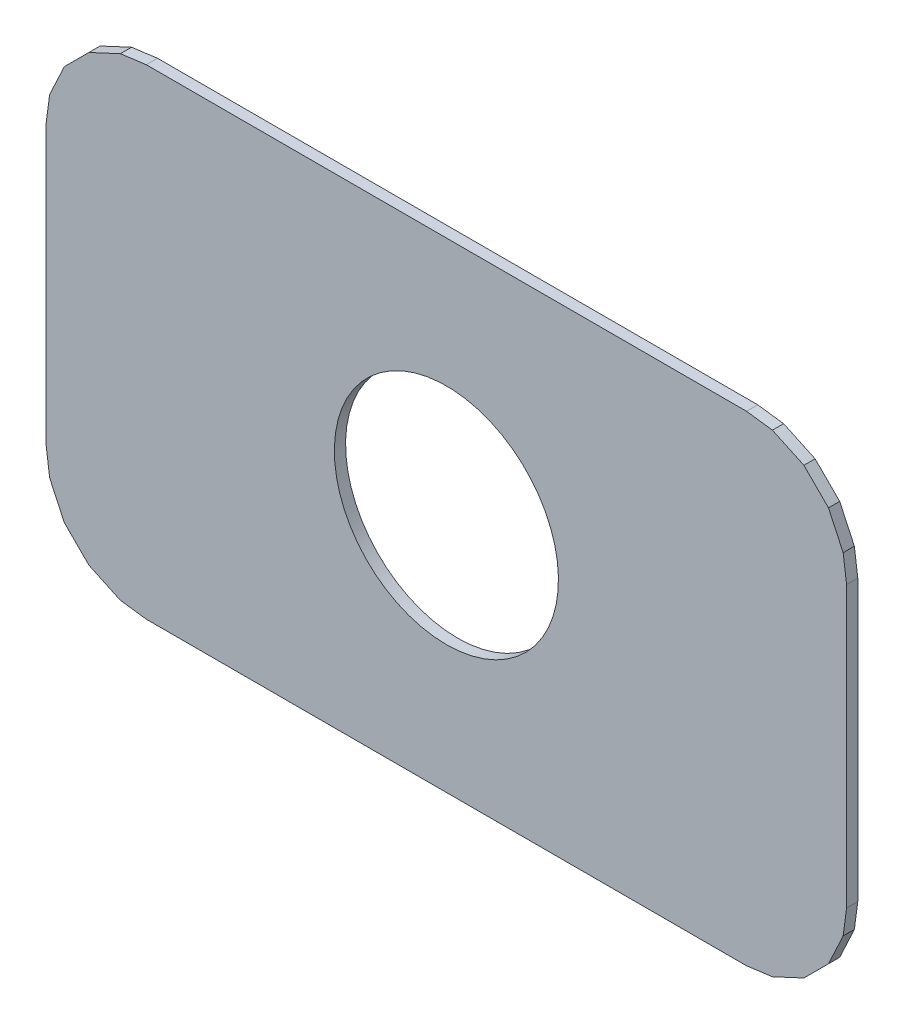
ISO-10303-21;
HEADER;
FILE_DESCRIPTION(('STEP AP214'),'2;1');
FILE_NAME('part.step','',(''),(''),'','','');
FILE_SCHEMA(('AUTOMOTIVE_DESIGN { 1 0 10303 214 1 1 1 1 }'));
ENDSEC;
DATA;
#1=APPLICATION_CONTEXT('core data for automotive mechanical design processes');
#2=APPLICATION_PROTOCOL_DEFINITION('international standard','automotive_design',2000,#1);
#3=PRODUCT_CONTEXT('',#1,'mechanical');
#4=PRODUCT('Part','Part','',(#3));
#5=PRODUCT_RELATED_PRODUCT_CATEGORY('part','',(#4));
#6=PRODUCT_DEFINITION_FORMATION('','',#4);
#7=PRODUCT_DEFINITION_CONTEXT('part definition',#1,'design');
#8=PRODUCT_DEFINITION('design','',#6,#7);
#9=PRODUCT_DEFINITION_SHAPE('','',#8);
#10=(LENGTH_UNIT() NAMED_UNIT(*) SI_UNIT(.MILLI.,.METRE.));
#11=(NAMED_UNIT(*) PLANE_ANGLE_UNIT() SI_UNIT($,.RADIAN.));
#12=(NAMED_UNIT(*) SI_UNIT($,.STERADIAN.) SOLID_ANGLE_UNIT());
#13=UNCERTAINTY_MEASURE_WITH_UNIT(LENGTH_MEASURE(1.E-05),#10,'distance_accuracy_value','');
#14=(GEOMETRIC_REPRESENTATION_CONTEXT(3) GLOBAL_UNCERTAINTY_ASSIGNED_CONTEXT((#13)) GLOBAL_UNIT_ASSIGNED_CONTEXT((#10,
#11,#12)) REPRESENTATION_CONTEXT('',''));
#15=CARTESIAN_POINT('',(0.,0.,0.));
#16=DIRECTION('',(0.,0.,1.));
#17=DIRECTION('',(1.,0.,0.));
#18=AXIS2_PLACEMENT_3D('',#15,#16,#17);
#19=CARTESIAN_POINT('',(115.401,-115.808,-0.045));
#20=DIRECTION('',(0.,0.,-1.));
#21=DIRECTION('',(0.,-1.,0.));
#22=AXIS2_PLACEMENT_3D('',#19,#20,#21);
#23=CYLINDRICAL_SURFACE('',#22,0.35);
#24=CARTESIAN_POINT('',(115.401,-115.808,1.67));
#25=DIRECTION('',(0.,0.,-1.));
#26=DIRECTION('',(0.,-1.,0.));
#27=AXIS2_PLACEMENT_3D('',#24,#25,#26);
#28=CIRCLE('',#27,0.35);
#29=CARTESIAN_POINT('',(115.401,-116.158,1.67));
#30=VERTEX_POINT('',#29);
#31=EDGE_CURVE('E415',#30,#30,#28,.T.);
#32=ORIENTED_EDGE('',*,*,#31,.T.);
#33=DIRECTION('',(0.,0.,1.));
#34=VECTOR('',#33,1.);
#35=CARTESIAN_POINT('',(115.401,-116.158,-0.045));
#36=LINE('',#35,#34);
#37=CARTESIAN_POINT('',(115.401,-116.158,1.705));
#38=VERTEX_POINT('',#37);
#39=EDGE_CURVE('E11',#30,#38,#36,.T.);
#40=ORIENTED_EDGE('',*,*,#39,.T.);
#41=CARTESIAN_POINT('',(115.401,-115.808,1.705));
#42=DIRECTION('',(0.,0.,-1.));
#43=DIRECTION('',(0.,-1.,0.));
#44=AXIS2_PLACEMENT_3D('',#41,#42,#43);
#45=CIRCLE('',#44,0.35);
#46=EDGE_CURVE('E335',#38,#38,#45,.T.);
#47=ORIENTED_EDGE('',*,*,#46,.F.);
#48=ORIENTED_EDGE('',*,*,#39,.F.);
#49=EDGE_LOOP('',(#32,#40,#47,#48));
#50=FACE_BOUND('',#49,.T.);
#51=ADVANCED_FACE('F17',(#50),#23,.F.);
#52=CARTESIAN_POINT('',(114.382619,-116.547352,1.67));
#53=DIRECTION('',(-0.422618610856986,-0.90630762424097,0.));
#54=DIRECTION('',(-0.90630762424097,0.422618610856986,0.));
#55=AXIS2_PLACEMENT_3D('',#52,#53,#54);
#56=PLANE('',#55);
#57=DIRECTION('',(0.,0.,1.));
#58=VECTOR('',#57,1.);
#59=CARTESIAN_POINT('',(114.382619,-116.547352,1.67));
#60=LINE('',#59,#58);
#61=CARTESIAN_POINT('',(114.382619,-116.547352,1.67));
#62=VERTEX_POINT('',#61);
#63=CARTESIAN_POINT('',(114.382619,-116.547352,1.705));
#64=VERTEX_POINT('',#63);
#65=EDGE_CURVE('E20',#62,#64,#60,.T.);
#66=ORIENTED_EDGE('',*,*,#65,.T.);
#67=DIRECTION('',(-0.90630762424097,0.422618610856986,0.));
#68=VECTOR('',#67,1.);
#69=CARTESIAN_POINT('',(114.382619,-116.547352,1.705));
#70=LINE('',#69,#68);
#71=CARTESIAN_POINT('',(114.284257,-116.501485,1.705));
#72=VERTEX_POINT('',#71);
#73=EDGE_CURVE('E285',#64,#72,#70,.T.);
#74=ORIENTED_EDGE('',*,*,#73,.T.);
#75=DIRECTION('',(0.,0.,1.));
#76=VECTOR('',#75,1.);
#77=CARTESIAN_POINT('',(114.284257,-116.501485,1.67));
#78=LINE('',#77,#76);
#79=CARTESIAN_POINT('',(114.284257,-116.501485,1.67));
#80=VERTEX_POINT('',#79);
#81=EDGE_CURVE('E384',#80,#72,#78,.T.);
#82=ORIENTED_EDGE('',*,*,#81,.F.);
#83=DIRECTION('',(-0.90630762424097,0.422618610856986,0.));
#84=VECTOR('',#83,1.);
#85=CARTESIAN_POINT('',(114.382619,-116.547352,1.67));
#86=LINE('',#85,#84);
#87=EDGE_CURVE('E370',#62,#80,#86,.T.);
#88=ORIENTED_EDGE('',*,*,#87,.F.);
#89=EDGE_LOOP('',(#66,#74,#82,#88));
#90=FACE_BOUND('',#89,.T.);
#91=ADVANCED_FACE('F533',(#90),#56,.T.);
#92=CARTESIAN_POINT('',(114.4635,-116.558,1.67));
#93=DIRECTION('',(-0.130523955190962,-0.99144515588171,0.));
#94=DIRECTION('',(-0.99144515588171,0.130523955190962,0.));
#95=AXIS2_PLACEMENT_3D('',#92,#93,#94);
#96=PLANE('',#95);
#97=DIRECTION('',(0.,0.,1.));
#98=VECTOR('',#97,1.);
#99=CARTESIAN_POINT('',(114.4635,-116.558,1.67));
#100=LINE('',#99,#98);
#101=CARTESIAN_POINT('',(114.4635,-116.558,1.67));
#102=VERTEX_POINT('',#101);
#103=CARTESIAN_POINT('',(114.4635,-116.558,1.705));
#104=VERTEX_POINT('',#103);
#105=EDGE_CURVE('E387',#102,#104,#100,.T.);
#106=ORIENTED_EDGE('',*,*,#105,.T.);
#107=DIRECTION('',(-0.99144515588171,0.130523955190962,0.));
#108=VECTOR('',#107,1.);
#109=CARTESIAN_POINT('',(114.4635,-116.558,1.705));
#110=LINE('',#109,#108);
#111=EDGE_CURVE('E454',#104,#64,#110,.T.);
#112=ORIENTED_EDGE('',*,*,#111,.T.);
#113=ORIENTED_EDGE('',*,*,#65,.F.);
#114=DIRECTION('',(-0.99144515588171,0.130523955190962,0.));
#115=VECTOR('',#114,1.);
#116=CARTESIAN_POINT('',(114.4635,-116.558,1.67));
#117=LINE('',#116,#115);
#118=EDGE_CURVE('E366',#102,#62,#117,.T.);
#119=ORIENTED_EDGE('',*,*,#118,.F.);
#120=EDGE_LOOP('',(#106,#112,#113,#119));
#121=FACE_BOUND('',#120,.T.);
#122=ADVANCED_FACE('F520',(#121),#96,.T.);
#123=CARTESIAN_POINT('',(114.284257,-116.501485,1.67));
#124=DIRECTION('',(-0.707106781186548,-0.707106781186548,0.));
#125=DIRECTION('',(-0.707106781186548,0.707106781186548,0.));
#126=AXIS2_PLACEMENT_3D('',#123,#124,#125);
#127=PLANE('',#126);
#128=ORIENTED_EDGE('',*,*,#81,.T.);
#129=DIRECTION('',(-0.707106781186548,0.707106781186548,0.));
#130=VECTOR('',#129,1.);
#131=CARTESIAN_POINT('',(114.284257,-116.501485,1.705));
#132=LINE('',#131,#130);
#133=CARTESIAN_POINT('',(114.207515,-116.424743,1.705));
#134=VERTEX_POINT('',#133);
#135=EDGE_CURVE('E281',#72,#134,#132,.T.);
#136=ORIENTED_EDGE('',*,*,#135,.T.);
#137=DIRECTION('',(0.,0.,1.));
#138=VECTOR('',#137,1.);
#139=CARTESIAN_POINT('',(114.207515,-116.424743,1.67));
#140=LINE('',#139,#138);
#141=CARTESIAN_POINT('',(114.207515,-116.424743,1.67));
#142=VERTEX_POINT('',#141);
#143=EDGE_CURVE('E512',#142,#134,#140,.T.);
#144=ORIENTED_EDGE('',*,*,#143,.F.);
#145=DIRECTION('',(-0.707106781186548,0.707106781186548,0.));
#146=VECTOR('',#145,1.);
#147=CARTESIAN_POINT('',(114.284257,-116.501485,1.67));
#148=LINE('',#147,#146);
#149=EDGE_CURVE('E377',#80,#142,#148,.T.);
#150=ORIENTED_EDGE('',*,*,#149,.F.);
#151=EDGE_LOOP('',(#128,#136,#144,#150));
#152=FACE_BOUND('',#151,.T.);
#153=ADVANCED_FACE('F830',(#152),#127,.T.);
#154=CARTESIAN_POINT('',(116.3385,-116.558,1.67));
#155=DIRECTION('',(0.,-1.,0.));
#156=DIRECTION('',(0.,0.,-1.));
#157=AXIS2_PLACEMENT_3D('',#154,#155,#156);
#158=PLANE('',#157);
#159=DIRECTION('',(0.,0.,1.));
#160=VECTOR('',#159,1.);
#161=CARTESIAN_POINT('',(116.3385,-116.558,1.67));
#162=LINE('',#161,#160);
#163=CARTESIAN_POINT('',(116.3385,-116.558,1.67));
#164=VERTEX_POINT('',#163);
#165=CARTESIAN_POINT('',(116.3385,-116.558,1.705));
#166=VERTEX_POINT('',#165);
#167=EDGE_CURVE('E347',#164,#166,#162,.T.);
#168=ORIENTED_EDGE('',*,*,#167,.T.);
#169=DIRECTION('',(-1.,0.,0.));
#170=VECTOR('',#169,1.);
#171=CARTESIAN_POINT('',(116.3385,-116.558,1.705));
#172=LINE('',#171,#170);
#173=EDGE_CURVE('E458',#166,#104,#172,.T.);
#174=ORIENTED_EDGE('',*,*,#173,.T.);
#175=ORIENTED_EDGE('',*,*,#105,.F.);
#176=DIRECTION('',(-1.,0.,0.));
#177=VECTOR('',#176,1.);
#178=CARTESIAN_POINT('',(116.3385,-116.558,1.67));
#179=LINE('',#178,#177);
#180=EDGE_CURVE('E314',#164,#102,#179,.T.);
#181=ORIENTED_EDGE('',*,*,#180,.F.);
#182=EDGE_LOOP('',(#168,#174,#175,#181));
#183=FACE_BOUND('',#182,.T.);
#184=ADVANCED_FACE('F526',(#183),#158,.T.);
#185=CARTESIAN_POINT('',(114.207515,-116.424743,1.67));
#186=DIRECTION('',(-0.90630762424097,-0.422618610856986,0.));
#187=DIRECTION('',(-0.422618610856986,0.90630762424097,0.));
#188=AXIS2_PLACEMENT_3D('',#185,#186,#187);
#189=PLANE('',#188);
#190=ORIENTED_EDGE('',*,*,#143,.T.);
#191=DIRECTION('',(-0.422618610856986,0.90630762424097,0.));
#192=VECTOR('',#191,1.);
#193=CARTESIAN_POINT('',(114.207515,-116.424743,1.705));
#194=LINE('',#193,#192);
#195=CARTESIAN_POINT('',(114.161648,-116.326381,1.705));
#196=VERTEX_POINT('',#195);
#197=EDGE_CURVE('E286',#134,#196,#194,.T.);
#198=ORIENTED_EDGE('',*,*,#197,.T.);
#199=DIRECTION('',(0.,0.,1.));
#200=VECTOR('',#199,1.);
#201=CARTESIAN_POINT('',(114.161648,-116.326381,1.67));
#202=LINE('',#201,#200);
#203=CARTESIAN_POINT('',(114.161648,-116.326381,1.67));
#204=VERTEX_POINT('',#203);
#205=EDGE_CURVE('E344',#204,#196,#202,.T.);
#206=ORIENTED_EDGE('',*,*,#205,.F.);
#207=DIRECTION('',(-0.422618610856986,0.90630762424097,0.));
#208=VECTOR('',#207,1.);
#209=CARTESIAN_POINT('',(114.207515,-116.424743,1.67));
#210=LINE('',#209,#208);
#211=EDGE_CURVE('E291',#142,#204,#210,.T.);
#212=ORIENTED_EDGE('',*,*,#211,.F.);
#213=EDGE_LOOP('',(#190,#198,#206,#212));
#214=FACE_BOUND('',#213,.T.);
#215=ADVANCED_FACE('F827',(#214),#189,.T.);
#216=CARTESIAN_POINT('',(116.419381,-116.547352,1.67));
#217=DIRECTION('',(0.130523955190962,-0.99144515588171,0.));
#218=DIRECTION('',(0.,0.,-1.));
#219=AXIS2_PLACEMENT_3D('',#216,#217,#218);
#220=PLANE('',#219);
#221=DIRECTION('',(0.,0.,1.));
#222=VECTOR('',#221,1.);
#223=CARTESIAN_POINT('',(116.419381,-116.547352,1.67));
#224=LINE('',#223,#222);
#225=CARTESIAN_POINT('',(116.419381,-116.547352,1.67));
#226=VERTEX_POINT('',#225);
#227=CARTESIAN_POINT('',(116.419381,-116.547352,1.705));
#228=VERTEX_POINT('',#227);
#229=EDGE_CURVE('E348',#226,#228,#224,.T.);
#230=ORIENTED_EDGE('',*,*,#229,.T.);
#231=DIRECTION('',(-0.99144515588171,-0.130523955190962,0.));
#232=VECTOR('',#231,1.);
#233=CARTESIAN_POINT('',(116.419381,-116.547352,1.705));
#234=LINE('',#233,#232);
#235=EDGE_CURVE('E468',#228,#166,#234,.T.);
#236=ORIENTED_EDGE('',*,*,#235,.T.);
#237=ORIENTED_EDGE('',*,*,#167,.F.);
#238=DIRECTION('',(-0.99144515588171,-0.130523955190962,0.));
#239=VECTOR('',#238,1.);
#240=CARTESIAN_POINT('',(116.419381,-116.547352,1.67));
#241=LINE('',#240,#239);
#242=EDGE_CURVE('E310',#226,#164,#241,.T.);
#243=ORIENTED_EDGE('',*,*,#242,.F.);
#244=EDGE_LOOP('',(#230,#236,#237,#243));
#245=FACE_BOUND('',#244,.T.);
#246=ADVANCED_FACE('F772',(#245),#220,.T.);
#247=CARTESIAN_POINT('',(114.161648,-116.326381,1.67));
#248=DIRECTION('',(-0.99144515588171,-0.130523955190962,0.));
#249=DIRECTION('',(-0.130523955190962,0.99144515588171,0.));
#250=AXIS2_PLACEMENT_3D('',#247,#248,#249);
#251=PLANE('',#250);
#252=ORIENTED_EDGE('',*,*,#205,.T.);
#253=DIRECTION('',(-0.130523955190962,0.99144515588171,0.));
#254=VECTOR('',#253,1.);
#255=CARTESIAN_POINT('',(114.161648,-116.326381,1.705));
#256=LINE('',#255,#254);
#257=CARTESIAN_POINT('',(114.151,-116.2455,1.705));
#258=VERTEX_POINT('',#257);
#259=EDGE_CURVE('E450',#196,#258,#256,.T.);
#260=ORIENTED_EDGE('',*,*,#259,.T.);
#261=DIRECTION('',(0.,0.,1.));
#262=VECTOR('',#261,1.);
#263=CARTESIAN_POINT('',(114.151,-116.2455,1.67));
#264=LINE('',#263,#262);
#265=CARTESIAN_POINT('',(114.151,-116.2455,1.67));
#266=VERTEX_POINT('',#265);
#267=EDGE_CURVE('E425',#266,#258,#264,.T.);
#268=ORIENTED_EDGE('',*,*,#267,.F.);
#269=DIRECTION('',(-0.130523955190962,0.99144515588171,0.));
#270=VECTOR('',#269,1.);
#271=CARTESIAN_POINT('',(114.161648,-116.326381,1.67));
#272=LINE('',#271,#270);
#273=EDGE_CURVE('E287',#204,#266,#272,.T.);
#274=ORIENTED_EDGE('',*,*,#273,.F.);
#275=EDGE_LOOP('',(#252,#260,#268,#274));
#276=FACE_BOUND('',#275,.T.);
#277=ADVANCED_FACE('F825',(#276),#251,.T.);
#278=CARTESIAN_POINT('',(116.517743,-116.501485,1.67));
#279=DIRECTION('',(0.422618610856986,-0.90630762424097,0.));
#280=DIRECTION('',(0.,0.,-1.));
#281=AXIS2_PLACEMENT_3D('',#278,#279,#280);
#282=PLANE('',#281);
#283=DIRECTION('',(0.,0.,1.));
#284=VECTOR('',#283,1.);
#285=CARTESIAN_POINT('',(116.517743,-116.501485,1.67));
#286=LINE('',#285,#284);
#287=CARTESIAN_POINT('',(116.517743,-116.501485,1.67));
#288=VERTEX_POINT('',#287);
#289=CARTESIAN_POINT('',(116.517743,-116.501485,1.705));
#290=VERTEX_POINT('',#289);
#291=EDGE_CURVE('E422',#288,#290,#286,.T.);
#292=ORIENTED_EDGE('',*,*,#291,.T.);
#293=DIRECTION('',(-0.90630762424097,-0.422618610856986,0.));
#294=VECTOR('',#293,1.);
#295=CARTESIAN_POINT('',(116.517743,-116.501485,1.705));
#296=LINE('',#295,#294);
#297=EDGE_CURVE('E472',#290,#228,#296,.T.);
#298=ORIENTED_EDGE('',*,*,#297,.T.);
#299=ORIENTED_EDGE('',*,*,#229,.F.);
#300=DIRECTION('',(-0.90630762424097,-0.422618610856986,0.));
#301=VECTOR('',#300,1.);
#302=CARTESIAN_POINT('',(116.517743,-116.501485,1.67));
#303=LINE('',#302,#301);
#304=EDGE_CURVE('E297',#288,#226,#303,.T.);
#305=ORIENTED_EDGE('',*,*,#304,.F.);
#306=EDGE_LOOP('',(#292,#298,#299,#305));
#307=FACE_BOUND('',#306,.T.);
#308=ADVANCED_FACE('F767',(#307),#282,.T.);
#309=CARTESIAN_POINT('',(114.151,-116.2455,1.67));
#310=DIRECTION('',(-1.,0.,0.));
#311=DIRECTION('',(0.,0.,1.));
#312=AXIS2_PLACEMENT_3D('',#309,#310,#311);
#313=PLANE('',#312);
#314=ORIENTED_EDGE('',*,*,#267,.T.);
#315=DIRECTION('',(0.,1.,0.));
#316=VECTOR('',#315,1.);
#317=CARTESIAN_POINT('',(114.151,-116.2455,1.705));
#318=LINE('',#317,#316);
#319=CARTESIAN_POINT('',(114.151,-115.3705,1.705));
#320=VERTEX_POINT('',#319);
#321=EDGE_CURVE('E446',#258,#320,#318,.T.);
#322=ORIENTED_EDGE('',*,*,#321,.T.);
#323=DIRECTION('',(0.,0.,1.));
#324=VECTOR('',#323,1.);
#325=CARTESIAN_POINT('',(114.151,-115.3705,1.67));
#326=LINE('',#325,#324);
#327=CARTESIAN_POINT('',(114.151,-115.3705,1.67));
#328=VERTEX_POINT('',#327);
#329=EDGE_CURVE('E426',#328,#320,#326,.T.);
#330=ORIENTED_EDGE('',*,*,#329,.F.);
#331=DIRECTION('',(0.,1.,0.));
#332=VECTOR('',#331,1.);
#333=CARTESIAN_POINT('',(114.151,-116.2455,1.67));
#334=LINE('',#333,#332);
#335=EDGE_CURVE('E290',#266,#328,#334,.T.);
#336=ORIENTED_EDGE('',*,*,#335,.F.);
#337=EDGE_LOOP('',(#314,#322,#330,#336));
#338=FACE_BOUND('',#337,.T.);
#339=ADVANCED_FACE('F822',(#338),#313,.T.);
#340=CARTESIAN_POINT('',(116.594485,-116.424743,1.67));
#341=DIRECTION('',(0.707106781186048,-0.707106781187048,0.));
#342=DIRECTION('',(0.,0.,-1.));
#343=AXIS2_PLACEMENT_3D('',#340,#341,#342);
#344=PLANE('',#343);
#345=DIRECTION('',(0.,0.,1.));
#346=VECTOR('',#345,1.);
#347=CARTESIAN_POINT('',(116.594485,-116.424743,1.67));
#348=LINE('',#347,#346);
#349=CARTESIAN_POINT('',(116.594485,-116.424743,1.67));
#350=VERTEX_POINT('',#349);
#351=CARTESIAN_POINT('',(116.594485,-116.424743,1.705));
#352=VERTEX_POINT('',#351);
#353=EDGE_CURVE('E502',#350,#352,#348,.T.);
#354=ORIENTED_EDGE('',*,*,#353,.T.);
#355=DIRECTION('',(-0.707106781187048,-0.707106781186048,0.));
#356=VECTOR('',#355,1.);
#357=CARTESIAN_POINT('',(116.594485,-116.424743,1.705));
#358=LINE('',#357,#356);
#359=EDGE_CURVE('E473',#352,#290,#358,.T.);
#360=ORIENTED_EDGE('',*,*,#359,.T.);
#361=ORIENTED_EDGE('',*,*,#291,.F.);
#362=DIRECTION('',(-0.707106781187048,-0.707106781186048,0.));
#363=VECTOR('',#362,1.);
#364=CARTESIAN_POINT('',(116.594485,-116.424743,1.67));
#365=LINE('',#364,#363);
#366=EDGE_CURVE('E293',#350,#288,#365,.T.);
#367=ORIENTED_EDGE('',*,*,#366,.F.);
#368=EDGE_LOOP('',(#354,#360,#361,#367));
#369=FACE_BOUND('',#368,.T.);
#370=ADVANCED_FACE('F776',(#369),#344,.T.);
#371=CARTESIAN_POINT('',(114.151,-115.3705,1.67));
#372=DIRECTION('',(-0.99144515588171,0.130523955190962,0.));
#373=DIRECTION('',(0.,0.,1.));
#374=AXIS2_PLACEMENT_3D('',#371,#372,#373);
#375=PLANE('',#374);
#376=ORIENTED_EDGE('',*,*,#329,.T.);
#377=DIRECTION('',(0.130523955190962,0.99144515588171,0.));
#378=VECTOR('',#377,1.);
#379=CARTESIAN_POINT('',(114.151,-115.3705,1.705));
#380=LINE('',#379,#378);
#381=CARTESIAN_POINT('',(114.161648,-115.289619,1.705));
#382=VERTEX_POINT('',#381);
#383=EDGE_CURVE('E442',#320,#382,#380,.T.);
#384=ORIENTED_EDGE('',*,*,#383,.T.);
#385=DIRECTION('',(0.,0.,1.));
#386=VECTOR('',#385,1.);
#387=CARTESIAN_POINT('',(114.161648,-115.289619,1.67));
#388=LINE('',#387,#386);
#389=CARTESIAN_POINT('',(114.161648,-115.289619,1.67));
#390=VERTEX_POINT('',#389);
#391=EDGE_CURVE('E412',#390,#382,#388,.T.);
#392=ORIENTED_EDGE('',*,*,#391,.F.);
#393=DIRECTION('',(0.130523955190962,0.99144515588171,0.));
#394=VECTOR('',#393,1.);
#395=CARTESIAN_POINT('',(114.151,-115.3705,1.67));
#396=LINE('',#395,#394);
#397=EDGE_CURVE('E305',#328,#390,#396,.T.);
#398=ORIENTED_EDGE('',*,*,#397,.F.);
#399=EDGE_LOOP('',(#376,#384,#392,#398));
#400=FACE_BOUND('',#399,.T.);
#401=ADVANCED_FACE('F818',(#400),#375,.T.);
#402=CARTESIAN_POINT('',(116.640352,-116.326381,1.67));
#403=DIRECTION('',(0.906307624241353,-0.422618610856164,0.));
#404=DIRECTION('',(0.,0.,-1.));
#405=AXIS2_PLACEMENT_3D('',#402,#403,#404);
#406=PLANE('',#405);
#407=DIRECTION('',(0.,0.,1.));
#408=VECTOR('',#407,1.);
#409=CARTESIAN_POINT('',(116.640352,-116.326381,1.67));
#410=LINE('',#409,#408);
#411=CARTESIAN_POINT('',(116.640352,-116.326381,1.67));
#412=VERTEX_POINT('',#411);
#413=CARTESIAN_POINT('',(116.640352,-116.326381,1.705));
#414=VERTEX_POINT('',#413);
#415=EDGE_CURVE('E403',#412,#414,#410,.T.);
#416=ORIENTED_EDGE('',*,*,#415,.T.);
#417=DIRECTION('',(-0.422618610856164,-0.906307624241353,0.));
#418=VECTOR('',#417,1.);
#419=CARTESIAN_POINT('',(116.640352,-116.326381,1.705));
#420=LINE('',#419,#418);
#421=EDGE_CURVE('E477',#414,#352,#420,.T.);
#422=ORIENTED_EDGE('',*,*,#421,.T.);
#423=ORIENTED_EDGE('',*,*,#353,.F.);
#424=DIRECTION('',(-0.422618610856164,-0.906307624241353,0.));
#425=VECTOR('',#424,1.);
#426=CARTESIAN_POINT('',(116.640352,-116.326381,1.67));
#427=LINE('',#426,#425);
#428=EDGE_CURVE('E298',#412,#350,#427,.T.);
#429=ORIENTED_EDGE('',*,*,#428,.F.);
#430=EDGE_LOOP('',(#416,#422,#423,#429));
#431=FACE_BOUND('',#430,.T.);
#432=ADVANCED_FACE('F781',(#431),#406,.T.);
#433=CARTESIAN_POINT('',(114.161648,-115.289619,1.67));
#434=DIRECTION('',(-0.90630762424097,0.422618610856986,0.));
#435=DIRECTION('',(0.,0.,1.));
#436=AXIS2_PLACEMENT_3D('',#433,#434,#435);
#437=PLANE('',#436);
#438=ORIENTED_EDGE('',*,*,#391,.T.);
#439=DIRECTION('',(0.422618610856986,0.90630762424097,0.));
#440=VECTOR('',#439,1.);
#441=CARTESIAN_POINT('',(114.161648,-115.289619,1.705));
#442=LINE('',#441,#440);
#443=CARTESIAN_POINT('',(114.207515,-115.191257,1.705));
#444=VERTEX_POINT('',#443);
#445=EDGE_CURVE('E438',#382,#444,#442,.T.);
#446=ORIENTED_EDGE('',*,*,#445,.T.);
#447=DIRECTION('',(0.,0.,1.));
#448=VECTOR('',#447,1.);
#449=CARTESIAN_POINT('',(114.207515,-115.191257,1.67));
#450=LINE('',#449,#448);
#451=CARTESIAN_POINT('',(114.207515,-115.191257,1.67));
#452=VERTEX_POINT('',#451);
#453=EDGE_CURVE('E391',#452,#444,#450,.T.);
#454=ORIENTED_EDGE('',*,*,#453,.F.);
#455=DIRECTION('',(0.422618610856986,0.90630762424097,0.));
#456=VECTOR('',#455,1.);
#457=CARTESIAN_POINT('',(114.161648,-115.289619,1.67));
#458=LINE('',#457,#456);
#459=EDGE_CURVE('E309',#390,#452,#458,.T.);
#460=ORIENTED_EDGE('',*,*,#459,.F.);
#461=EDGE_LOOP('',(#438,#446,#454,#460));
#462=FACE_BOUND('',#461,.T.);
#463=ADVANCED_FACE('F813',(#462),#437,.T.);
#464=CARTESIAN_POINT('',(116.651,-116.2455,1.67));
#465=DIRECTION('',(0.99144515588171,-0.130523955190962,0.));
#466=DIRECTION('',(0.,0.,-1.));
#467=AXIS2_PLACEMENT_3D('',#464,#465,#466);
#468=PLANE('',#467);
#469=DIRECTION('',(0.,0.,1.));
#470=VECTOR('',#469,1.);
#471=CARTESIAN_POINT('',(116.651,-116.2455,1.67));
#472=LINE('',#471,#470);
#473=CARTESIAN_POINT('',(116.651,-116.2455,1.67));
#474=VERTEX_POINT('',#473);
#475=CARTESIAN_POINT('',(116.651,-116.2455,1.705));
#476=VERTEX_POINT('',#475);
#477=EDGE_CURVE('E388',#474,#476,#472,.T.);
#478=ORIENTED_EDGE('',*,*,#477,.T.);
#479=DIRECTION('',(-0.130523955190962,-0.99144515588171,0.));
#480=VECTOR('',#479,1.);
#481=CARTESIAN_POINT('',(116.651,-116.2455,1.705));
#482=LINE('',#481,#480);
#483=EDGE_CURVE('E481',#476,#414,#482,.T.);
#484=ORIENTED_EDGE('',*,*,#483,.T.);
#485=ORIENTED_EDGE('',*,*,#415,.F.);
#486=DIRECTION('',(-0.130523955190962,-0.99144515588171,0.));
#487=VECTOR('',#486,1.);
#488=CARTESIAN_POINT('',(116.651,-116.2455,1.67));
#489=LINE('',#488,#487);
#490=EDGE_CURVE('E331',#474,#412,#489,.T.);
#491=ORIENTED_EDGE('',*,*,#490,.F.);
#492=EDGE_LOOP('',(#478,#484,#485,#491));
#493=FACE_BOUND('',#492,.T.);
#494=ADVANCED_FACE('F784',(#493),#468,.T.);
#495=CARTESIAN_POINT('',(114.207515,-115.191257,1.67));
#496=DIRECTION('',(-0.707106781186548,0.707106781186548,0.));
#497=DIRECTION('',(0.,0.,1.));
#498=AXIS2_PLACEMENT_3D('',#495,#496,#497);
#499=PLANE('',#498);
#500=ORIENTED_EDGE('',*,*,#453,.T.);
#501=DIRECTION('',(0.707106781186548,0.707106781186548,0.));
#502=VECTOR('',#501,1.);
#503=CARTESIAN_POINT('',(114.207515,-115.191257,1.705));
#504=LINE('',#503,#502);
#505=CARTESIAN_POINT('',(114.284257,-115.114515,1.705));
#506=VERTEX_POINT('',#505);
#507=EDGE_CURVE('E434',#444,#506,#504,.T.);
#508=ORIENTED_EDGE('',*,*,#507,.T.);
#509=DIRECTION('',(0.,0.,1.));
#510=VECTOR('',#509,1.);
#511=CARTESIAN_POINT('',(114.284257,-115.114515,1.67));
#512=LINE('',#511,#510);
#513=CARTESIAN_POINT('',(114.284257,-115.114515,1.67));
#514=VERTEX_POINT('',#513);
#515=EDGE_CURVE('E392',#514,#506,#512,.T.);
#516=ORIENTED_EDGE('',*,*,#515,.F.);
#517=DIRECTION('',(0.707106781186548,0.707106781186548,0.));
#518=VECTOR('',#517,1.);
#519=CARTESIAN_POINT('',(114.207515,-115.191257,1.67));
#520=LINE('',#519,#518);
#521=EDGE_CURVE('E396',#452,#514,#520,.T.);
#522=ORIENTED_EDGE('',*,*,#521,.F.);
#523=EDGE_LOOP('',(#500,#508,#516,#522));
#524=FACE_BOUND('',#523,.T.);
#525=ADVANCED_FACE('F810',(#524),#499,.T.);
#526=CARTESIAN_POINT('',(116.651,-115.3705,1.67));
#527=DIRECTION('',(1.,0.,0.));
#528=DIRECTION('',(0.,1.,0.));
#529=AXIS2_PLACEMENT_3D('',#526,#527,#528);
#530=PLANE('',#529);
#531=DIRECTION('',(0.,0.,1.));
#532=VECTOR('',#531,1.);
#533=CARTESIAN_POINT('',(116.651,-115.3705,1.67));
#534=LINE('',#533,#532);
#535=CARTESIAN_POINT('',(116.651,-115.3705,1.67));
#536=VERTEX_POINT('',#535);
#537=CARTESIAN_POINT('',(116.651,-115.3705,1.705));
#538=VERTEX_POINT('',#537);
#539=EDGE_CURVE('E495',#536,#538,#534,.T.);
#540=ORIENTED_EDGE('',*,*,#539,.T.);
#541=DIRECTION('',(0.,-1.,0.));
#542=VECTOR('',#541,1.);
#543=CARTESIAN_POINT('',(116.651,-115.3705,1.705));
#544=LINE('',#543,#542);
#545=EDGE_CURVE('E359',#538,#476,#544,.T.);
#546=ORIENTED_EDGE('',*,*,#545,.T.);
#547=ORIENTED_EDGE('',*,*,#477,.F.);
#548=DIRECTION('',(0.,-1.,0.));
#549=VECTOR('',#548,1.);
#550=CARTESIAN_POINT('',(116.651,-115.3705,1.67));
#551=LINE('',#550,#549);
#552=EDGE_CURVE('E303',#536,#474,#551,.T.);
#553=ORIENTED_EDGE('',*,*,#552,.F.);
#554=EDGE_LOOP('',(#540,#546,#547,#553));
#555=FACE_BOUND('',#554,.T.);
#556=ADVANCED_FACE('F787',(#555),#530,.T.);
#557=CARTESIAN_POINT('',(114.284257,-115.114515,1.67));
#558=DIRECTION('',(-0.422618610856986,0.90630762424097,0.));
#559=DIRECTION('',(0.,0.,1.));
#560=AXIS2_PLACEMENT_3D('',#557,#558,#559);
#561=PLANE('',#560);
#562=ORIENTED_EDGE('',*,*,#515,.T.);
#563=DIRECTION('',(0.90630762424097,0.422618610856986,0.));
#564=VECTOR('',#563,1.);
#565=CARTESIAN_POINT('',(114.284257,-115.114515,1.705));
#566=LINE('',#565,#564);
#567=CARTESIAN_POINT('',(114.382619,-115.068648,1.705));
#568=VERTEX_POINT('',#567);
#569=EDGE_CURVE('E430',#506,#568,#566,.T.);
#570=ORIENTED_EDGE('',*,*,#569,.T.);
#571=DIRECTION('',(0.,0.,1.));
#572=VECTOR('',#571,1.);
#573=CARTESIAN_POINT('',(114.382619,-115.068648,1.67));
#574=LINE('',#573,#572);
#575=CARTESIAN_POINT('',(114.382619,-115.068648,1.67));
#576=VERTEX_POINT('',#575);
#577=EDGE_CURVE('E492',#576,#568,#574,.T.);
#578=ORIENTED_EDGE('',*,*,#577,.F.);
#579=DIRECTION('',(0.90630762424097,0.422618610856986,0.));
#580=VECTOR('',#579,1.);
#581=CARTESIAN_POINT('',(114.284257,-115.114515,1.67));
#582=LINE('',#581,#580);
#583=EDGE_CURVE('E400',#514,#576,#582,.T.);
#584=ORIENTED_EDGE('',*,*,#583,.F.);
#585=EDGE_LOOP('',(#562,#570,#578,#584));
#586=FACE_BOUND('',#585,.T.);
#587=ADVANCED_FACE('F806',(#586),#561,.T.);
#588=CARTESIAN_POINT('',(116.640352,-115.289619,1.67));
#589=DIRECTION('',(0.99144515588171,0.130523955190962,0.));
#590=DIRECTION('',(0.,0.,-1.));
#591=AXIS2_PLACEMENT_3D('',#588,#589,#590);
#592=PLANE('',#591);
#593=DIRECTION('',(0.,0.,1.));
#594=VECTOR('',#593,1.);
#595=CARTESIAN_POINT('',(116.640352,-115.289619,1.67));
#596=LINE('',#595,#594);
#597=CARTESIAN_POINT('',(116.640352,-115.289619,1.67));
#598=VERTEX_POINT('',#597);
#599=CARTESIAN_POINT('',(116.640352,-115.289619,1.705));
#600=VERTEX_POINT('',#599);
#601=EDGE_CURVE('E46',#598,#600,#596,.T.);
#602=ORIENTED_EDGE('',*,*,#601,.T.);
#603=DIRECTION('',(0.130523955190962,-0.99144515588171,0.));
#604=VECTOR('',#603,1.);
#605=CARTESIAN_POINT('',(116.640352,-115.289619,1.705));
#606=LINE('',#605,#604);
#607=EDGE_CURVE('E336',#600,#538,#606,.T.);
#608=ORIENTED_EDGE('',*,*,#607,.T.);
#609=ORIENTED_EDGE('',*,*,#539,.F.);
#610=DIRECTION('',(0.130523955190962,-0.99144515588171,0.));
#611=VECTOR('',#610,1.);
#612=CARTESIAN_POINT('',(116.640352,-115.289619,1.67));
#613=LINE('',#612,#611);
#614=EDGE_CURVE('E299',#598,#536,#613,.T.);
#615=ORIENTED_EDGE('',*,*,#614,.F.);
#616=EDGE_LOOP('',(#602,#608,#609,#615));
#617=FACE_BOUND('',#616,.T.);
#618=ADVANCED_FACE('F789',(#617),#592,.T.);
#619=CARTESIAN_POINT('',(114.382619,-115.068648,1.67));
#620=DIRECTION('',(-0.130523955190962,0.99144515588171,0.));
#621=DIRECTION('',(0.,0.,1.));
#622=AXIS2_PLACEMENT_3D('',#619,#620,#621);
#623=PLANE('',#622);
#624=ORIENTED_EDGE('',*,*,#577,.T.);
#625=DIRECTION('',(0.99144515588171,0.130523955190962,0.));
#626=VECTOR('',#625,1.);
#627=CARTESIAN_POINT('',(114.382619,-115.068648,1.705));
#628=LINE('',#627,#626);
#629=CARTESIAN_POINT('',(114.4635,-115.058,1.705));
#630=VERTEX_POINT('',#629);
#631=EDGE_CURVE('E421',#568,#630,#628,.T.);
#632=ORIENTED_EDGE('',*,*,#631,.T.);
#633=DIRECTION('',(0.,0.,1.));
#634=VECTOR('',#633,1.);
#635=CARTESIAN_POINT('',(114.4635,-115.058,1.67));
#636=LINE('',#635,#634);
#637=CARTESIAN_POINT('',(114.4635,-115.058,1.67));
#638=VERTEX_POINT('',#637);
#639=EDGE_CURVE('E373',#638,#630,#636,.T.);
#640=ORIENTED_EDGE('',*,*,#639,.F.);
#641=DIRECTION('',(0.99144515588171,0.130523955190962,0.));
#642=VECTOR('',#641,1.);
#643=CARTESIAN_POINT('',(114.382619,-115.068648,1.67));
#644=LINE('',#643,#642);
#645=EDGE_CURVE('E407',#576,#638,#644,.T.);
#646=ORIENTED_EDGE('',*,*,#645,.F.);
#647=EDGE_LOOP('',(#624,#632,#640,#646));
#648=FACE_BOUND('',#647,.T.);
#649=ADVANCED_FACE('F801',(#648),#623,.T.);
#650=CARTESIAN_POINT('',(116.594485,-115.191257,1.67));
#651=DIRECTION('',(0.906307624241353,0.422618610856164,0.));
#652=DIRECTION('',(0.,0.,-1.));
#653=AXIS2_PLACEMENT_3D('',#650,#651,#652);
#654=PLANE('',#653);
#655=DIRECTION('',(0.,0.,1.));
#656=VECTOR('',#655,1.);
#657=CARTESIAN_POINT('',(116.594485,-115.191257,1.67));
#658=LINE('',#657,#656);
#659=CARTESIAN_POINT('',(116.594485,-115.191257,1.67));
#660=VERTEX_POINT('',#659);
#661=CARTESIAN_POINT('',(116.594485,-115.191257,1.705));
#662=VERTEX_POINT('',#661);
#663=EDGE_CURVE('E343',#660,#662,#658,.T.);
#664=ORIENTED_EDGE('',*,*,#663,.T.);
#665=DIRECTION('',(0.422618610856164,-0.906307624241353,0.));
#666=VECTOR('',#665,1.);
#667=CARTESIAN_POINT('',(116.594485,-115.191257,1.705));
#668=LINE('',#667,#666);
#669=EDGE_CURVE('E332',#662,#600,#668,.T.);
#670=ORIENTED_EDGE('',*,*,#669,.T.);
#671=ORIENTED_EDGE('',*,*,#601,.F.);
#672=DIRECTION('',(0.422618610856164,-0.906307624241353,0.));
#673=VECTOR('',#672,1.);
#674=CARTESIAN_POINT('',(116.594485,-115.191257,1.67));
#675=LINE('',#674,#673);
#676=EDGE_CURVE('E304',#660,#598,#675,.T.);
#677=ORIENTED_EDGE('',*,*,#676,.F.);
#678=EDGE_LOOP('',(#664,#670,#671,#677));
#679=FACE_BOUND('',#678,.T.);
#680=ADVANCED_FACE('F792',(#679),#654,.T.);
#681=CARTESIAN_POINT('',(114.4635,-115.058,1.67));
#682=DIRECTION('',(0.,1.,0.));
#683=DIRECTION('',(1.,0.,0.));
#684=AXIS2_PLACEMENT_3D('',#681,#682,#683);
#685=PLANE('',#684);
#686=ORIENTED_EDGE('',*,*,#639,.T.);
#687=DIRECTION('',(1.,0.,0.));
#688=VECTOR('',#687,1.);
#689=CARTESIAN_POINT('',(114.4635,-115.058,1.705));
#690=LINE('',#689,#688);
#691=CARTESIAN_POINT('',(116.3385,-115.058,1.705));
#692=VERTEX_POINT('',#691);
#693=EDGE_CURVE('E418',#630,#692,#690,.T.);
#694=ORIENTED_EDGE('',*,*,#693,.T.);
#695=DIRECTION('',(0.,0.,1.));
#696=VECTOR('',#695,1.);
#697=CARTESIAN_POINT('',(116.3385,-115.058,1.67));
#698=LINE('',#697,#696);
#699=CARTESIAN_POINT('',(116.3385,-115.058,1.67));
#700=VERTEX_POINT('',#699);
#701=EDGE_CURVE('E266',#700,#692,#698,.T.);
#702=ORIENTED_EDGE('',*,*,#701,.F.);
#703=DIRECTION('',(1.,0.,0.));
#704=VECTOR('',#703,1.);
#705=CARTESIAN_POINT('',(114.4635,-115.058,1.67));
#706=LINE('',#705,#704);
#707=EDGE_CURVE('E249',#638,#700,#706,.T.);
#708=ORIENTED_EDGE('',*,*,#707,.F.);
#709=EDGE_LOOP('',(#686,#694,#702,#708));
#710=FACE_BOUND('',#709,.T.);
#711=ADVANCED_FACE('F798',(#710),#685,.T.);
#712=CARTESIAN_POINT('',(0.,0.,1.705));
#713=DIRECTION('',(0.,0.,1.));
#714=DIRECTION('',(1.,0.,0.));
#715=AXIS2_PLACEMENT_3D('',#712,#713,#714);
#716=PLANE('',#715);
#717=ORIENTED_EDGE('',*,*,#46,.T.);
#718=EDGE_LOOP('',(#717));
#719=FACE_BOUND('',#718,.T.);
#720=DIRECTION('',(0.90630762424097,-0.422618610856986,0.));
#721=VECTOR('',#720,1.);
#722=CARTESIAN_POINT('',(116.419381,-115.068648,1.705));
#723=LINE('',#722,#721);
#724=CARTESIAN_POINT('',(116.419381,-115.068648,1.705));
#725=VERTEX_POINT('',#724);
#726=CARTESIAN_POINT('',(116.517743,-115.114515,1.705));
#727=VERTEX_POINT('',#726);
#728=EDGE_CURVE('E272',#725,#727,#723,.T.);
#729=ORIENTED_EDGE('',*,*,#728,.F.);
#730=DIRECTION('',(0.99144515588171,-0.130523955190962,0.));
#731=VECTOR('',#730,1.);
#732=CARTESIAN_POINT('',(116.3385,-115.058,1.705));
#733=LINE('',#732,#731);
#734=EDGE_CURVE('E256',#692,#725,#733,.T.);
#735=ORIENTED_EDGE('',*,*,#734,.F.);
#736=ORIENTED_EDGE('',*,*,#693,.F.);
#737=ORIENTED_EDGE('',*,*,#631,.F.);
#738=ORIENTED_EDGE('',*,*,#569,.F.);
#739=ORIENTED_EDGE('',*,*,#507,.F.);
#740=ORIENTED_EDGE('',*,*,#445,.F.);
#741=ORIENTED_EDGE('',*,*,#383,.F.);
#742=ORIENTED_EDGE('',*,*,#321,.F.);
#743=ORIENTED_EDGE('',*,*,#259,.F.);
#744=ORIENTED_EDGE('',*,*,#197,.F.);
#745=ORIENTED_EDGE('',*,*,#135,.F.);
#746=ORIENTED_EDGE('',*,*,#73,.F.);
#747=ORIENTED_EDGE('',*,*,#111,.F.);
#748=ORIENTED_EDGE('',*,*,#173,.F.);
#749=ORIENTED_EDGE('',*,*,#235,.F.);
#750=ORIENTED_EDGE('',*,*,#297,.F.);
#751=ORIENTED_EDGE('',*,*,#359,.F.);
#752=ORIENTED_EDGE('',*,*,#421,.F.);
#753=ORIENTED_EDGE('',*,*,#483,.F.);
#754=ORIENTED_EDGE('',*,*,#545,.F.);
#755=ORIENTED_EDGE('',*,*,#607,.F.);
#756=ORIENTED_EDGE('',*,*,#669,.F.);
#757=DIRECTION('',(0.707106781187048,-0.707106781186048,0.));
#758=VECTOR('',#757,1.);
#759=CARTESIAN_POINT('',(116.517743,-115.114515,1.705));
#760=LINE('',#759,#758);
#761=EDGE_CURVE('E255',#727,#662,#760,.T.);
#762=ORIENTED_EDGE('',*,*,#761,.F.);
#763=EDGE_LOOP('',(#729,#735,#736,#737,#738,#739,#740,#741,#742,#743,#744,#745,#746,#747,#748,
#749,#750,#751,#752,#753,#754,#755,#756,#762));
#764=FACE_BOUND('',#763,.T.);
#765=ADVANCED_FACE('F529',(#719,#764),#716,.T.);
#766=CARTESIAN_POINT('',(0.,0.,1.67));
#767=DIRECTION('',(0.,0.,1.));
#768=DIRECTION('',(1.,0.,0.));
#769=AXIS2_PLACEMENT_3D('',#766,#767,#768);
#770=PLANE('',#769);
#771=ORIENTED_EDGE('',*,*,#31,.F.);
#772=EDGE_LOOP('',(#771));
#773=FACE_BOUND('',#772,.T.);
#774=DIRECTION('',(0.707106781187048,-0.707106781186048,0.));
#775=VECTOR('',#774,1.);
#776=CARTESIAN_POINT('',(116.517743,-115.114515,1.67));
#777=LINE('',#776,#775);
#778=CARTESIAN_POINT('',(116.517743,-115.114515,1.67));
#779=VERTEX_POINT('',#778);
#780=EDGE_CURVE('E320',#779,#660,#777,.T.);
#781=ORIENTED_EDGE('',*,*,#780,.T.);
#782=ORIENTED_EDGE('',*,*,#676,.T.);
#783=ORIENTED_EDGE('',*,*,#614,.T.);
#784=ORIENTED_EDGE('',*,*,#552,.T.);
#785=ORIENTED_EDGE('',*,*,#490,.T.);
#786=ORIENTED_EDGE('',*,*,#428,.T.);
#787=ORIENTED_EDGE('',*,*,#366,.T.);
#788=ORIENTED_EDGE('',*,*,#304,.T.);
#789=ORIENTED_EDGE('',*,*,#242,.T.);
#790=ORIENTED_EDGE('',*,*,#180,.T.);
#791=ORIENTED_EDGE('',*,*,#118,.T.);
#792=ORIENTED_EDGE('',*,*,#87,.T.);
#793=ORIENTED_EDGE('',*,*,#149,.T.);
#794=ORIENTED_EDGE('',*,*,#211,.T.);
#795=ORIENTED_EDGE('',*,*,#273,.T.);
#796=ORIENTED_EDGE('',*,*,#335,.T.);
#797=ORIENTED_EDGE('',*,*,#397,.T.);
#798=ORIENTED_EDGE('',*,*,#459,.T.);
#799=ORIENTED_EDGE('',*,*,#521,.T.);
#800=ORIENTED_EDGE('',*,*,#583,.T.);
#801=ORIENTED_EDGE('',*,*,#645,.T.);
#802=ORIENTED_EDGE('',*,*,#707,.T.);
#803=DIRECTION('',(0.99144515588171,-0.130523955190962,0.));
#804=VECTOR('',#803,1.);
#805=CARTESIAN_POINT('',(116.3385,-115.058,1.67));
#806=LINE('',#805,#804);
#807=CARTESIAN_POINT('',(116.419381,-115.068648,1.67));
#808=VERTEX_POINT('',#807);
#809=EDGE_CURVE('E241',#700,#808,#806,.T.);
#810=ORIENTED_EDGE('',*,*,#809,.T.);
#811=DIRECTION('',(0.90630762424097,-0.422618610856986,0.));
#812=VECTOR('',#811,1.);
#813=CARTESIAN_POINT('',(116.419381,-115.068648,1.67));
#814=LINE('',#813,#812);
#815=EDGE_CURVE('E245',#808,#779,#814,.T.);
#816=ORIENTED_EDGE('',*,*,#815,.T.);
#817=EDGE_LOOP('',(#781,#782,#783,#784,#785,#786,#787,#788,#789,#790,#791,#792,#793,#794,#795,
#796,#797,#798,#799,#800,#801,#802,#810,#816));
#818=FACE_BOUND('',#817,.T.);
#819=ADVANCED_FACE('F244',(#773,#818),#770,.F.);
#820=CARTESIAN_POINT('',(116.517743,-115.114515,1.67));
#821=DIRECTION('',(0.707106781186048,0.707106781187048,0.));
#822=DIRECTION('',(0.,0.,-1.));
#823=AXIS2_PLACEMENT_3D('',#820,#821,#822);
#824=PLANE('',#823);
#825=DIRECTION('',(0.,0.,1.));
#826=VECTOR('',#825,1.);
#827=CARTESIAN_POINT('',(116.517743,-115.114515,1.67));
#828=LINE('',#827,#826);
#829=EDGE_CURVE('E264',#779,#727,#828,.T.);
#830=ORIENTED_EDGE('',*,*,#829,.T.);
#831=ORIENTED_EDGE('',*,*,#761,.T.);
#832=ORIENTED_EDGE('',*,*,#663,.F.);
#833=ORIENTED_EDGE('',*,*,#780,.F.);
#834=EDGE_LOOP('',(#830,#831,#832,#833));
#835=FACE_BOUND('',#834,.T.);
#836=ADVANCED_FACE('F794',(#835),#824,.T.);
#837=CARTESIAN_POINT('',(116.3385,-115.058,1.67));
#838=DIRECTION('',(0.130523955190962,0.99144515588171,0.));
#839=DIRECTION('',(0.,0.,-1.));
#840=AXIS2_PLACEMENT_3D('',#837,#838,#839);
#841=PLANE('',#840);
#842=ORIENTED_EDGE('',*,*,#701,.T.);
#843=ORIENTED_EDGE('',*,*,#734,.T.);
#844=DIRECTION('',(0.,0.,1.));
#845=VECTOR('',#844,1.);
#846=CARTESIAN_POINT('',(116.419381,-115.068648,1.67));
#847=LINE('',#846,#845);
#848=EDGE_CURVE('E262',#808,#725,#847,.T.);
#849=ORIENTED_EDGE('',*,*,#848,.F.);
#850=ORIENTED_EDGE('',*,*,#809,.F.);
#851=EDGE_LOOP('',(#842,#843,#849,#850));
#852=FACE_BOUND('',#851,.T.);
#853=ADVANCED_FACE('F268',(#852),#841,.T.);
#854=CARTESIAN_POINT('',(116.419381,-115.068648,1.67));
#855=DIRECTION('',(0.422618610856986,0.90630762424097,0.));
#856=DIRECTION('',(0.,0.,-1.));
#857=AXIS2_PLACEMENT_3D('',#854,#855,#856);
#858=PLANE('',#857);
#859=ORIENTED_EDGE('',*,*,#848,.T.);
#860=ORIENTED_EDGE('',*,*,#728,.T.);
#861=ORIENTED_EDGE('',*,*,#829,.F.);
#862=ORIENTED_EDGE('',*,*,#815,.F.);
#863=EDGE_LOOP('',(#859,#860,#861,#862));
#864=FACE_BOUND('',#863,.T.);
#865=ADVANCED_FACE('F260',(#864),#858,.T.);
#866=CLOSED_SHELL('',(#51,#91,#122,#153,#184,#215,#246,#277,#308,#339,#370,#401,#432,#463,#494,
#525,#556,#587,#618,#649,#680,#711,#765,#819,#836,#853,#865));
#867=MANIFOLD_SOLID_BREP('B1',#866);
#868=ADVANCED_BREP_SHAPE_REPRESENTATION('',(#18,#867),#14);
#869=SHAPE_DEFINITION_REPRESENTATION(#9,#868);
ENDSEC;
END-ISO-10303-21;
